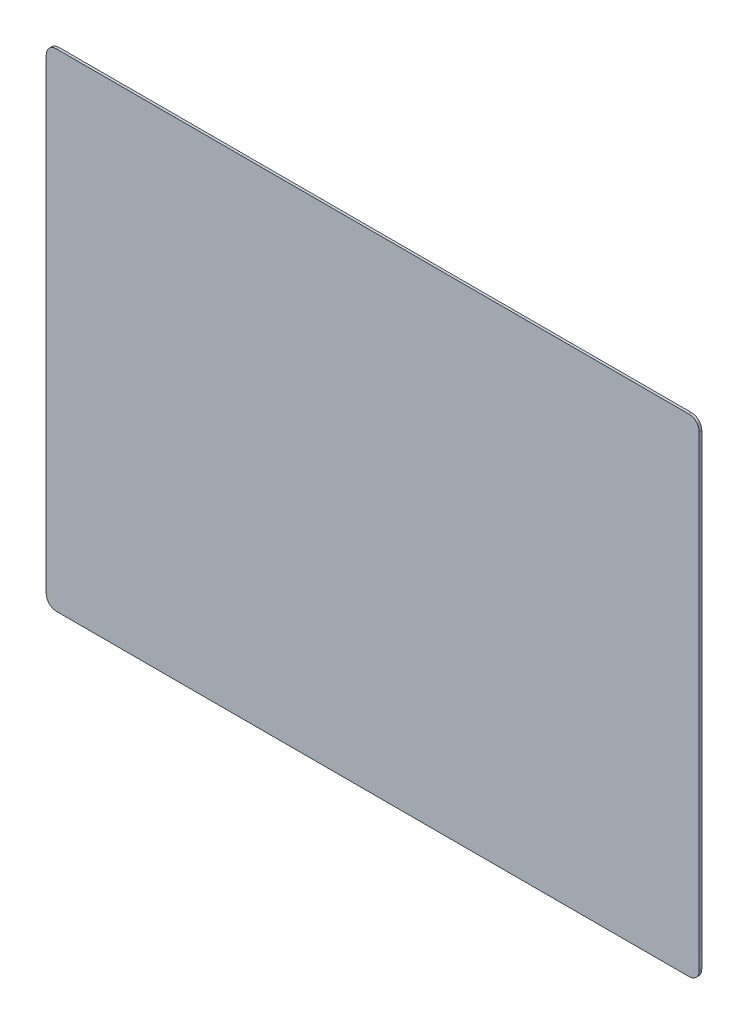
ISO-10303-21;
HEADER;
FILE_DESCRIPTION(('STEP AP214'),'2;1');
FILE_NAME('part.step','',(''),(''),'','','');
FILE_SCHEMA(('AUTOMOTIVE_DESIGN { 1 0 10303 214 1 1 1 1 }'));
ENDSEC;
DATA;
#1=APPLICATION_CONTEXT('core data for automotive mechanical design processes');
#2=APPLICATION_PROTOCOL_DEFINITION('international standard','automotive_design',2000,#1);
#3=PRODUCT_CONTEXT('',#1,'mechanical');
#4=PRODUCT('Part','Part','',(#3));
#5=PRODUCT_RELATED_PRODUCT_CATEGORY('part','',(#4));
#6=PRODUCT_DEFINITION_FORMATION('','',#4);
#7=PRODUCT_DEFINITION_CONTEXT('part definition',#1,'design');
#8=PRODUCT_DEFINITION('design','',#6,#7);
#9=PRODUCT_DEFINITION_SHAPE('','',#8);
#10=(LENGTH_UNIT() NAMED_UNIT(*) SI_UNIT(.MILLI.,.METRE.));
#11=(NAMED_UNIT(*) PLANE_ANGLE_UNIT() SI_UNIT($,.RADIAN.));
#12=(NAMED_UNIT(*) SI_UNIT($,.STERADIAN.) SOLID_ANGLE_UNIT());
#13=UNCERTAINTY_MEASURE_WITH_UNIT(LENGTH_MEASURE(1.E-05),#10,'distance_accuracy_value','');
#14=(GEOMETRIC_REPRESENTATION_CONTEXT(3) GLOBAL_UNCERTAINTY_ASSIGNED_CONTEXT((#13)) GLOBAL_UNIT_ASSIGNED_CONTEXT((#10,
#11,#12)) REPRESENTATION_CONTEXT('',''));
#15=CARTESIAN_POINT('',(0.,0.,0.));
#16=DIRECTION('',(0.,0.,1.));
#17=DIRECTION('',(1.,0.,0.));
#18=AXIS2_PLACEMENT_3D('',#15,#16,#17);
#19=CARTESIAN_POINT('',(362.068512449567,424.888699836252,0.79375));
#20=DIRECTION('',(1.,0.,0.));
#21=DIRECTION('',(0.,0.,-1.));
#22=AXIS2_PLACEMENT_3D('',#19,#20,#21);
#23=PLANE('',#22);
#24=DIRECTION('',(0.,-1.,0.));
#25=VECTOR('',#24,1.);
#26=CARTESIAN_POINT('',(362.068512449567,424.888699836252,0.79375));
#27=LINE('',#26,#25);
#28=CARTESIAN_POINT('',(362.068512449567,421.713699836252,0.79375));
#29=VERTEX_POINT('',#28);
#30=CARTESIAN_POINT('',(362.068512449567,276.457449836252,0.79375));
#31=VERTEX_POINT('',#30);
#32=EDGE_CURVE('E120',#29,#31,#27,.T.);
#33=ORIENTED_EDGE('',*,*,#32,.F.);
#34=DIRECTION('',(0.,0.,-1.));
#35=VECTOR('',#34,1.);
#36=CARTESIAN_POINT('',(362.068512449567,421.713699836252,0.79375));
#37=LINE('',#36,#35);
#38=CARTESIAN_POINT('',(362.068512449567,421.713699836252,0.));
#39=VERTEX_POINT('',#38);
#40=EDGE_CURVE('E105',#29,#39,#37,.T.);
#41=ORIENTED_EDGE('',*,*,#40,.T.);
#42=DIRECTION('',(0.,-1.,0.));
#43=VECTOR('',#42,1.);
#44=CARTESIAN_POINT('',(362.068512449567,424.888699836252,0.));
#45=LINE('',#44,#43);
#46=CARTESIAN_POINT('',(362.068512449567,276.457449836252,0.));
#47=VERTEX_POINT('',#46);
#48=EDGE_CURVE('E117',#39,#47,#45,.T.);
#49=ORIENTED_EDGE('',*,*,#48,.T.);
#50=DIRECTION('',(0.,0.,-1.));
#51=VECTOR('',#50,1.);
#52=CARTESIAN_POINT('',(362.068512449567,276.457449836252,0.79375));
#53=LINE('',#52,#51);
#54=EDGE_CURVE('E122',#47,#31,#53,.F.);
#55=ORIENTED_EDGE('',*,*,#54,.T.);
#56=EDGE_LOOP('',(#33,#41,#49,#55));
#57=FACE_BOUND('',#56,.T.);
#58=ADVANCED_FACE('F35',(#57),#23,.F.);
#59=CARTESIAN_POINT('',(362.068512449567,273.282449836252,0.79375));
#60=DIRECTION('',(0.,1.,0.));
#61=DIRECTION('',(0.,0.,1.));
#62=AXIS2_PLACEMENT_3D('',#59,#60,#61);
#63=PLANE('',#62);
#64=DIRECTION('',(1.,0.,0.));
#65=VECTOR('',#64,1.);
#66=CARTESIAN_POINT('',(362.068512449567,273.282449836252,0.));
#67=LINE('',#66,#65);
#68=CARTESIAN_POINT('',(365.243512449567,273.282449836252,0.));
#69=VERTEX_POINT('',#68);
#70=CARTESIAN_POINT('',(562.093512449567,273.282449836252,0.));
#71=VERTEX_POINT('',#70);
#72=EDGE_CURVE('E126',#69,#71,#67,.T.);
#73=ORIENTED_EDGE('',*,*,#72,.T.);
#74=DIRECTION('',(0.,0.,-1.));
#75=VECTOR('',#74,1.);
#76=CARTESIAN_POINT('',(562.093512449567,273.282449836252,0.79375));
#77=LINE('',#76,#75);
#78=CARTESIAN_POINT('',(562.093512449567,273.282449836252,0.79375));
#79=VERTEX_POINT('',#78);
#80=EDGE_CURVE('E11',#71,#79,#77,.F.);
#81=ORIENTED_EDGE('',*,*,#80,.T.);
#82=DIRECTION('',(1.,0.,0.));
#83=VECTOR('',#82,1.);
#84=CARTESIAN_POINT('',(362.068512449567,273.282449836252,0.79375));
#85=LINE('',#84,#83);
#86=CARTESIAN_POINT('',(365.243512449567,273.282449836252,0.79375));
#87=VERTEX_POINT('',#86);
#88=EDGE_CURVE('E162',#87,#79,#85,.T.);
#89=ORIENTED_EDGE('',*,*,#88,.F.);
#90=DIRECTION('',(0.,0.,-1.));
#91=VECTOR('',#90,1.);
#92=CARTESIAN_POINT('',(365.243512449567,273.282449836252,0.79375));
#93=LINE('',#92,#91);
#94=EDGE_CURVE('E43',#87,#69,#93,.T.);
#95=ORIENTED_EDGE('',*,*,#94,.T.);
#96=EDGE_LOOP('',(#73,#81,#89,#95));
#97=FACE_BOUND('',#96,.T.);
#98=ADVANCED_FACE('F160',(#97),#63,.F.);
#99=CARTESIAN_POINT('',(565.268512449567,424.888699836252,0.79375));
#100=DIRECTION('',(-1.,0.,0.));
#101=DIRECTION('',(0.,0.,1.));
#102=AXIS2_PLACEMENT_3D('',#99,#100,#101);
#103=PLANE('',#102);
#104=DIRECTION('',(0.,1.,0.));
#105=VECTOR('',#104,1.);
#106=CARTESIAN_POINT('',(565.268512449567,424.888699836252,0.));
#107=LINE('',#106,#105);
#108=CARTESIAN_POINT('',(565.268512449567,276.457449836252,0.));
#109=VERTEX_POINT('',#108);
#110=CARTESIAN_POINT('',(565.268512449567,421.713699836252,0.));
#111=VERTEX_POINT('',#110);
#112=EDGE_CURVE('E129',#109,#111,#107,.T.);
#113=ORIENTED_EDGE('',*,*,#112,.T.);
#114=DIRECTION('',(0.,0.,-1.));
#115=VECTOR('',#114,1.);
#116=CARTESIAN_POINT('',(565.268512449567,421.713699836252,0.79375));
#117=LINE('',#116,#115);
#118=CARTESIAN_POINT('',(565.268512449567,421.713699836252,0.79375));
#119=VERTEX_POINT('',#118);
#120=EDGE_CURVE('E50',#111,#119,#117,.F.);
#121=ORIENTED_EDGE('',*,*,#120,.T.);
#122=DIRECTION('',(0.,1.,0.));
#123=VECTOR('',#122,1.);
#124=CARTESIAN_POINT('',(565.268512449567,424.888699836252,0.79375));
#125=LINE('',#124,#123);
#126=CARTESIAN_POINT('',(565.268512449567,276.457449836252,0.79375));
#127=VERTEX_POINT('',#126);
#128=EDGE_CURVE('E170',#127,#119,#125,.T.);
#129=ORIENTED_EDGE('',*,*,#128,.F.);
#130=DIRECTION('',(0.,0.,-1.));
#131=VECTOR('',#130,1.);
#132=CARTESIAN_POINT('',(565.268512449567,276.457449836252,0.79375));
#133=LINE('',#132,#131);
#134=EDGE_CURVE('E153',#127,#109,#133,.T.);
#135=ORIENTED_EDGE('',*,*,#134,.T.);
#136=EDGE_LOOP('',(#113,#121,#129,#135));
#137=FACE_BOUND('',#136,.T.);
#138=ADVANCED_FACE('F169',(#137),#103,.F.);
#139=CARTESIAN_POINT('',(362.068512449567,424.888699836252,0.79375));
#140=DIRECTION('',(0.,-1.,0.));
#141=DIRECTION('',(0.,0.,-1.));
#142=AXIS2_PLACEMENT_3D('',#139,#140,#141);
#143=PLANE('',#142);
#144=DIRECTION('',(-1.,0.,0.));
#145=VECTOR('',#144,1.);
#146=CARTESIAN_POINT('',(362.068512449567,424.888699836252,0.));
#147=LINE('',#146,#145);
#148=CARTESIAN_POINT('',(562.093512449567,424.888699836252,0.));
#149=VERTEX_POINT('',#148);
#150=CARTESIAN_POINT('',(365.243512449567,424.888699836252,0.));
#151=VERTEX_POINT('',#150);
#152=EDGE_CURVE('E136',#149,#151,#147,.T.);
#153=ORIENTED_EDGE('',*,*,#152,.T.);
#154=DIRECTION('',(0.,0.,-1.));
#155=VECTOR('',#154,1.);
#156=CARTESIAN_POINT('',(365.243512449567,424.888699836252,0.79375));
#157=LINE('',#156,#155);
#158=CARTESIAN_POINT('',(365.243512449567,424.888699836252,0.79375));
#159=VERTEX_POINT('',#158);
#160=EDGE_CURVE('E106',#151,#159,#157,.F.);
#161=ORIENTED_EDGE('',*,*,#160,.T.);
#162=DIRECTION('',(-1.,0.,0.));
#163=VECTOR('',#162,1.);
#164=CARTESIAN_POINT('',(362.068512449567,424.888699836252,0.79375));
#165=LINE('',#164,#163);
#166=CARTESIAN_POINT('',(562.093512449567,424.888699836252,0.79375));
#167=VERTEX_POINT('',#166);
#168=EDGE_CURVE('E132',#167,#159,#165,.T.);
#169=ORIENTED_EDGE('',*,*,#168,.F.);
#170=DIRECTION('',(0.,0.,-1.));
#171=VECTOR('',#170,1.);
#172=CARTESIAN_POINT('',(562.093512449567,424.888699836252,0.79375));
#173=LINE('',#172,#171);
#174=EDGE_CURVE('E111',#167,#149,#173,.T.);
#175=ORIENTED_EDGE('',*,*,#174,.T.);
#176=EDGE_LOOP('',(#153,#161,#169,#175));
#177=FACE_BOUND('',#176,.T.);
#178=ADVANCED_FACE('F198',(#177),#143,.F.);
#179=CARTESIAN_POINT('',(362.068512449567,273.282449836252,0.79375));
#180=DIRECTION('',(0.,0.,1.));
#181=DIRECTION('',(1.,0.,0.));
#182=AXIS2_PLACEMENT_3D('',#179,#180,#181);
#183=PLANE('',#182);
#184=ORIENTED_EDGE('',*,*,#168,.T.);
#185=CARTESIAN_POINT('',(365.243512449567,421.713699836252,0.79375));
#186=DIRECTION('',(0.,0.,1.));
#187=DIRECTION('',(1.,0.,0.));
#188=AXIS2_PLACEMENT_3D('',#185,#186,#187);
#189=CIRCLE('',#188,3.175);
#190=EDGE_CURVE('E151',#159,#29,#189,.T.);
#191=ORIENTED_EDGE('',*,*,#190,.T.);
#192=ORIENTED_EDGE('',*,*,#32,.T.);
#193=CARTESIAN_POINT('',(365.243512449567,276.457449836252,0.79375));
#194=DIRECTION('',(0.,0.,1.));
#195=DIRECTION('',(1.,0.,0.));
#196=AXIS2_PLACEMENT_3D('',#193,#194,#195);
#197=CIRCLE('',#196,3.175);
#198=EDGE_CURVE('E146',#31,#87,#197,.T.);
#199=ORIENTED_EDGE('',*,*,#198,.T.);
#200=ORIENTED_EDGE('',*,*,#88,.T.);
#201=CARTESIAN_POINT('',(562.093512449567,276.457449836252,0.79375));
#202=DIRECTION('',(0.,0.,1.));
#203=DIRECTION('',(1.,0.,0.));
#204=AXIS2_PLACEMENT_3D('',#201,#202,#203);
#205=CIRCLE('',#204,3.175);
#206=EDGE_CURVE('E57',#79,#127,#205,.T.);
#207=ORIENTED_EDGE('',*,*,#206,.T.);
#208=ORIENTED_EDGE('',*,*,#128,.T.);
#209=CARTESIAN_POINT('',(562.093512449567,421.713699836252,0.79375));
#210=DIRECTION('',(0.,0.,1.));
#211=DIRECTION('',(1.,0.,0.));
#212=AXIS2_PLACEMENT_3D('',#209,#210,#211);
#213=CIRCLE('',#212,3.175);
#214=EDGE_CURVE('E149',#119,#167,#213,.T.);
#215=ORIENTED_EDGE('',*,*,#214,.T.);
#216=EDGE_LOOP('',(#184,#191,#192,#199,#200,#207,#208,#215));
#217=FACE_BOUND('',#216,.T.);
#218=ADVANCED_FACE('F175',(#217),#183,.T.);
#219=CARTESIAN_POINT('',(362.068512449567,273.282449836252,0.));
#220=DIRECTION('',(0.,0.,1.));
#221=DIRECTION('',(1.,0.,0.));
#222=AXIS2_PLACEMENT_3D('',#219,#220,#221);
#223=PLANE('',#222);
#224=ORIENTED_EDGE('',*,*,#48,.F.);
#225=CARTESIAN_POINT('',(365.243512449567,421.713699836252,0.));
#226=DIRECTION('',(0.,0.,1.));
#227=DIRECTION('',(1.,0.,0.));
#228=AXIS2_PLACEMENT_3D('',#225,#226,#227);
#229=CIRCLE('',#228,3.175);
#230=EDGE_CURVE('E101',#39,#151,#229,.F.);
#231=ORIENTED_EDGE('',*,*,#230,.T.);
#232=ORIENTED_EDGE('',*,*,#152,.F.);
#233=CARTESIAN_POINT('',(562.093512449567,421.713699836252,0.));
#234=DIRECTION('',(0.,0.,1.));
#235=DIRECTION('',(1.,0.,0.));
#236=AXIS2_PLACEMENT_3D('',#233,#234,#235);
#237=CIRCLE('',#236,3.175);
#238=EDGE_CURVE('E112',#149,#111,#237,.F.);
#239=ORIENTED_EDGE('',*,*,#238,.T.);
#240=ORIENTED_EDGE('',*,*,#112,.F.);
#241=CARTESIAN_POINT('',(562.093512449567,276.457449836252,0.));
#242=DIRECTION('',(0.,0.,1.));
#243=DIRECTION('',(1.,0.,0.));
#244=AXIS2_PLACEMENT_3D('',#241,#242,#243);
#245=CIRCLE('',#244,3.175);
#246=EDGE_CURVE('E140',#109,#71,#245,.F.);
#247=ORIENTED_EDGE('',*,*,#246,.T.);
#248=ORIENTED_EDGE('',*,*,#72,.F.);
#249=CARTESIAN_POINT('',(365.243512449567,276.457449836252,0.));
#250=DIRECTION('',(0.,0.,1.));
#251=DIRECTION('',(1.,0.,0.));
#252=AXIS2_PLACEMENT_3D('',#249,#250,#251);
#253=CIRCLE('',#252,3.175);
#254=EDGE_CURVE('E121',#69,#47,#253,.F.);
#255=ORIENTED_EDGE('',*,*,#254,.T.);
#256=EDGE_LOOP('',(#224,#231,#232,#239,#240,#247,#248,#255));
#257=FACE_BOUND('',#256,.T.);
#258=ADVANCED_FACE('F124',(#257),#223,.F.);
#259=CARTESIAN_POINT('',(365.243512449567,421.713699836252,0.79375));
#260=DIRECTION('',(0.,0.,-1.));
#261=DIRECTION('',(-1.,0.,0.));
#262=AXIS2_PLACEMENT_3D('',#259,#260,#261);
#263=CYLINDRICAL_SURFACE('',#262,3.175);
#264=ORIENTED_EDGE('',*,*,#190,.F.);
#265=ORIENTED_EDGE('',*,*,#160,.F.);
#266=ORIENTED_EDGE('',*,*,#230,.F.);
#267=ORIENTED_EDGE('',*,*,#40,.F.);
#268=EDGE_LOOP('',(#264,#265,#266,#267));
#269=FACE_BOUND('',#268,.T.);
#270=ADVANCED_FACE('F104',(#269),#263,.T.);
#271=CARTESIAN_POINT('',(562.093512449567,421.713699836252,0.79375));
#272=DIRECTION('',(0.,0.,-1.));
#273=DIRECTION('',(-1.,0.,0.));
#274=AXIS2_PLACEMENT_3D('',#271,#272,#273);
#275=CYLINDRICAL_SURFACE('',#274,3.175);
#276=ORIENTED_EDGE('',*,*,#214,.F.);
#277=ORIENTED_EDGE('',*,*,#120,.F.);
#278=ORIENTED_EDGE('',*,*,#238,.F.);
#279=ORIENTED_EDGE('',*,*,#174,.F.);
#280=EDGE_LOOP('',(#276,#277,#278,#279));
#281=FACE_BOUND('',#280,.T.);
#282=ADVANCED_FACE('F180',(#281),#275,.T.);
#283=CARTESIAN_POINT('',(562.093512449567,276.457449836252,0.79375));
#284=DIRECTION('',(0.,0.,-1.));
#285=DIRECTION('',(-1.,0.,0.));
#286=AXIS2_PLACEMENT_3D('',#283,#284,#285);
#287=CYLINDRICAL_SURFACE('',#286,3.175);
#288=ORIENTED_EDGE('',*,*,#206,.F.);
#289=ORIENTED_EDGE('',*,*,#80,.F.);
#290=ORIENTED_EDGE('',*,*,#246,.F.);
#291=ORIENTED_EDGE('',*,*,#134,.F.);
#292=EDGE_LOOP('',(#288,#289,#290,#291));
#293=FACE_BOUND('',#292,.T.);
#294=ADVANCED_FACE('F168',(#293),#287,.T.);
#295=CARTESIAN_POINT('',(365.243512449567,276.457449836252,0.79375));
#296=DIRECTION('',(0.,0.,-1.));
#297=DIRECTION('',(-1.,0.,0.));
#298=AXIS2_PLACEMENT_3D('',#295,#296,#297);
#299=CYLINDRICAL_SURFACE('',#298,3.175);
#300=ORIENTED_EDGE('',*,*,#198,.F.);
#301=ORIENTED_EDGE('',*,*,#54,.F.);
#302=ORIENTED_EDGE('',*,*,#254,.F.);
#303=ORIENTED_EDGE('',*,*,#94,.F.);
#304=EDGE_LOOP('',(#300,#301,#302,#303));
#305=FACE_BOUND('',#304,.T.);
#306=ADVANCED_FACE('F37',(#305),#299,.T.);
#307=CLOSED_SHELL('',(#58,#98,#138,#178,#218,#258,#270,#282,#294,#306));
#308=MANIFOLD_SOLID_BREP('B2',#307);
#309=ADVANCED_BREP_SHAPE_REPRESENTATION('',(#18,#308),#14);
#310=SHAPE_DEFINITION_REPRESENTATION(#9,#309);
ENDSEC;
END-ISO-10303-21;
